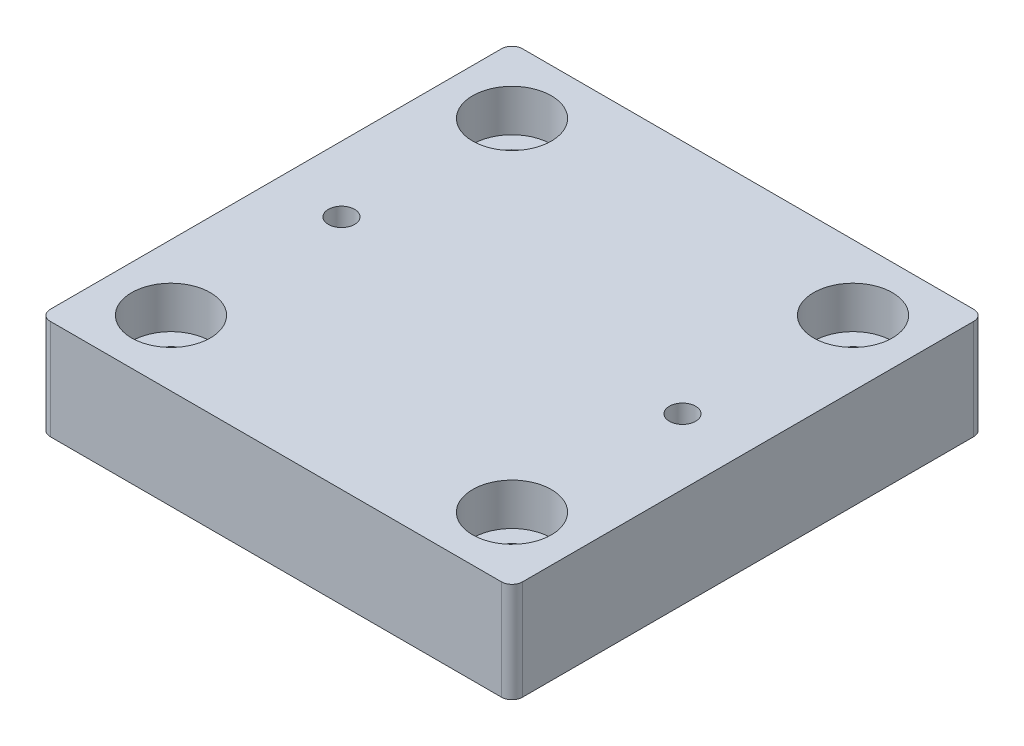
ISO-10303-21;
HEADER;
FILE_DESCRIPTION(('STEP AP214'),'2;1');
FILE_NAME('part.step','',(''),(''),'','','');
FILE_SCHEMA(('AUTOMOTIVE_DESIGN { 1 0 10303 214 1 1 1 1 }'));
ENDSEC;
DATA;
#1=APPLICATION_CONTEXT('core data for automotive mechanical design processes');
#2=APPLICATION_PROTOCOL_DEFINITION('international standard','automotive_design',2000,#1);
#3=PRODUCT_CONTEXT('',#1,'mechanical');
#4=PRODUCT('Part','Part','',(#3));
#5=PRODUCT_RELATED_PRODUCT_CATEGORY('part','',(#4));
#6=PRODUCT_DEFINITION_FORMATION('','',#4);
#7=PRODUCT_DEFINITION_CONTEXT('part definition',#1,'design');
#8=PRODUCT_DEFINITION('design','',#6,#7);
#9=PRODUCT_DEFINITION_SHAPE('','',#8);
#10=(LENGTH_UNIT() NAMED_UNIT(*) SI_UNIT(.MILLI.,.METRE.));
#11=(NAMED_UNIT(*) PLANE_ANGLE_UNIT() SI_UNIT($,.RADIAN.));
#12=(NAMED_UNIT(*) SI_UNIT($,.STERADIAN.) SOLID_ANGLE_UNIT());
#13=UNCERTAINTY_MEASURE_WITH_UNIT(LENGTH_MEASURE(1.E-05),#10,'distance_accuracy_value','');
#14=(GEOMETRIC_REPRESENTATION_CONTEXT(3) GLOBAL_UNCERTAINTY_ASSIGNED_CONTEXT((#13)) GLOBAL_UNIT_ASSIGNED_CONTEXT((#10,
#11,#12)) REPRESENTATION_CONTEXT('',''));
#15=CARTESIAN_POINT('',(0.,0.,0.));
#16=DIRECTION('',(0.,0.,1.));
#17=DIRECTION('',(1.,0.,0.));
#18=AXIS2_PLACEMENT_3D('',#15,#16,#17);
#19=CARTESIAN_POINT('',(-32.5,19.05,-32.5));
#20=DIRECTION('',(0.,-1.,0.));
#21=DIRECTION('',(0.,0.,-1.));
#22=AXIS2_PLACEMENT_3D('',#19,#20,#21);
#23=CYLINDRICAL_SURFACE('',#22,4.);
#24=CARTESIAN_POINT('',(-32.5,0.,-32.5));
#25=DIRECTION('',(0.,1.,0.));
#26=DIRECTION('',(0.,0.,1.));
#27=AXIS2_PLACEMENT_3D('',#24,#25,#26);
#28=CIRCLE('',#27,4.);
#29=CARTESIAN_POINT('',(-32.5,0.,-28.5));
#30=VERTEX_POINT('',#29);
#31=EDGE_CURVE('E162',#30,#30,#28,.T.);
#32=ORIENTED_EDGE('',*,*,#31,.F.);
#33=EDGE_LOOP('',(#32));
#34=FACE_BOUND('',#33,.T.);
#35=CARTESIAN_POINT('',(-32.5,11.05,-32.5));
#36=DIRECTION('',(0.,1.,0.));
#37=DIRECTION('',(0.,0.,1.));
#38=AXIS2_PLACEMENT_3D('',#35,#36,#37);
#39=CIRCLE('',#38,4.);
#40=CARTESIAN_POINT('',(-32.5,11.05,-28.5));
#41=VERTEX_POINT('',#40);
#42=EDGE_CURVE('E57',#41,#41,#39,.T.);
#43=ORIENTED_EDGE('',*,*,#42,.T.);
#44=EDGE_LOOP('',(#43));
#45=FACE_BOUND('',#44,.T.);
#46=ADVANCED_FACE('F53',(#34,#45),#23,.F.);
#47=CARTESIAN_POINT('',(32.5,19.05,-32.5));
#48=DIRECTION('',(0.,-1.,0.));
#49=DIRECTION('',(0.,0.,-1.));
#50=AXIS2_PLACEMENT_3D('',#47,#48,#49);
#51=CYLINDRICAL_SURFACE('',#50,4.00000000000001);
#52=CARTESIAN_POINT('',(32.5,0.,-32.5));
#53=DIRECTION('',(0.,1.,0.));
#54=DIRECTION('',(0.,0.,1.));
#55=AXIS2_PLACEMENT_3D('',#52,#53,#54);
#56=CIRCLE('',#55,4.00000000000001);
#57=CARTESIAN_POINT('',(32.5,0.,-28.5));
#58=VERTEX_POINT('',#57);
#59=EDGE_CURVE('E224',#58,#58,#56,.T.);
#60=ORIENTED_EDGE('',*,*,#59,.F.);
#61=EDGE_LOOP('',(#60));
#62=FACE_BOUND('',#61,.T.);
#63=CARTESIAN_POINT('',(32.5,11.05,-32.5));
#64=DIRECTION('',(0.,1.,0.));
#65=DIRECTION('',(0.,0.,1.));
#66=AXIS2_PLACEMENT_3D('',#63,#64,#65);
#67=CIRCLE('',#66,4.00000000000001);
#68=CARTESIAN_POINT('',(32.5,11.05,-28.5));
#69=VERTEX_POINT('',#68);
#70=EDGE_CURVE('E206',#69,#69,#67,.T.);
#71=ORIENTED_EDGE('',*,*,#70,.T.);
#72=EDGE_LOOP('',(#71));
#73=FACE_BOUND('',#72,.T.);
#74=ADVANCED_FACE('F278',(#62,#73),#51,.F.);
#75=CARTESIAN_POINT('',(32.5,19.05,32.5));
#76=DIRECTION('',(0.,-1.,0.));
#77=DIRECTION('',(0.,0.,-1.));
#78=AXIS2_PLACEMENT_3D('',#75,#76,#77);
#79=CYLINDRICAL_SURFACE('',#78,4.00000000000001);
#80=CARTESIAN_POINT('',(32.5,0.,32.5));
#81=DIRECTION('',(0.,1.,0.));
#82=DIRECTION('',(0.,0.,1.));
#83=AXIS2_PLACEMENT_3D('',#80,#81,#82);
#84=CIRCLE('',#83,4.00000000000001);
#85=CARTESIAN_POINT('',(32.5,0.,36.5));
#86=VERTEX_POINT('',#85);
#87=EDGE_CURVE('E218',#86,#86,#84,.T.);
#88=ORIENTED_EDGE('',*,*,#87,.F.);
#89=EDGE_LOOP('',(#88));
#90=FACE_BOUND('',#89,.T.);
#91=CARTESIAN_POINT('',(32.5,11.05,32.5));
#92=DIRECTION('',(0.,1.,0.));
#93=DIRECTION('',(0.,0.,1.));
#94=AXIS2_PLACEMENT_3D('',#91,#92,#93);
#95=CIRCLE('',#94,4.00000000000001);
#96=CARTESIAN_POINT('',(32.5,11.05,36.5));
#97=VERTEX_POINT('',#96);
#98=EDGE_CURVE('E202',#97,#97,#95,.T.);
#99=ORIENTED_EDGE('',*,*,#98,.T.);
#100=EDGE_LOOP('',(#99));
#101=FACE_BOUND('',#100,.T.);
#102=ADVANCED_FACE('F284',(#90,#101),#79,.F.);
#103=CARTESIAN_POINT('',(-32.5,19.05,32.5));
#104=DIRECTION('',(0.,-1.,0.));
#105=DIRECTION('',(0.,0.,-1.));
#106=AXIS2_PLACEMENT_3D('',#103,#104,#105);
#107=CYLINDRICAL_SURFACE('',#106,4.);
#108=CARTESIAN_POINT('',(-32.5,0.,32.5));
#109=DIRECTION('',(0.,1.,0.));
#110=DIRECTION('',(0.,0.,1.));
#111=AXIS2_PLACEMENT_3D('',#108,#109,#110);
#112=CIRCLE('',#111,4.);
#113=CARTESIAN_POINT('',(-32.5,0.,36.5));
#114=VERTEX_POINT('',#113);
#115=EDGE_CURVE('E213',#114,#114,#112,.T.);
#116=ORIENTED_EDGE('',*,*,#115,.F.);
#117=EDGE_LOOP('',(#116));
#118=FACE_BOUND('',#117,.T.);
#119=CARTESIAN_POINT('',(-32.5,11.05,32.5));
#120=DIRECTION('',(0.,1.,0.));
#121=DIRECTION('',(0.,0.,1.));
#122=AXIS2_PLACEMENT_3D('',#119,#120,#121);
#123=CIRCLE('',#122,4.);
#124=CARTESIAN_POINT('',(-32.5,11.05,36.5));
#125=VERTEX_POINT('',#124);
#126=EDGE_CURVE('E198',#125,#125,#123,.T.);
#127=ORIENTED_EDGE('',*,*,#126,.T.);
#128=EDGE_LOOP('',(#127));
#129=FACE_BOUND('',#128,.T.);
#130=ADVANCED_FACE('F291',(#118,#129),#107,.F.);
#131=CARTESIAN_POINT('',(-43.,19.05,43.));
#132=DIRECTION('',(0.,-1.,0.));
#133=DIRECTION('',(0.,0.,-1.));
#134=AXIS2_PLACEMENT_3D('',#131,#132,#133);
#135=PLANE('',#134);
#136=CARTESIAN_POINT('',(-32.5,19.05,0.));
#137=DIRECTION('',(0.,1.,0.));
#138=DIRECTION('',(0.,0.,1.));
#139=AXIS2_PLACEMENT_3D('',#136,#137,#138);
#140=CIRCLE('',#139,2.5);
#141=CARTESIAN_POINT('',(-32.5,19.05,2.5));
#142=VERTEX_POINT('',#141);
#143=EDGE_CURVE('E561',#142,#142,#140,.T.);
#144=ORIENTED_EDGE('',*,*,#143,.F.);
#145=EDGE_LOOP('',(#144));
#146=FACE_BOUND('',#145,.T.);
#147=CARTESIAN_POINT('',(32.5,19.05,0.));
#148=DIRECTION('',(0.,1.,0.));
#149=DIRECTION('',(0.,0.,1.));
#150=AXIS2_PLACEMENT_3D('',#147,#148,#149);
#151=CIRCLE('',#150,2.5);
#152=CARTESIAN_POINT('',(32.5,19.05,2.5));
#153=VERTEX_POINT('',#152);
#154=EDGE_CURVE('E565',#153,#153,#151,.T.);
#155=ORIENTED_EDGE('',*,*,#154,.F.);
#156=EDGE_LOOP('',(#155));
#157=FACE_BOUND('',#156,.T.);
#158=CARTESIAN_POINT('',(-32.5,19.05,-32.5));
#159=DIRECTION('',(0.,1.,0.));
#160=DIRECTION('',(0.,0.,1.));
#161=AXIS2_PLACEMENT_3D('',#158,#159,#160);
#162=CIRCLE('',#161,7.5);
#163=CARTESIAN_POINT('',(-32.5,19.05,-25.));
#164=VERTEX_POINT('',#163);
#165=EDGE_CURVE('E342',#164,#164,#162,.T.);
#166=ORIENTED_EDGE('',*,*,#165,.F.);
#167=EDGE_LOOP('',(#166));
#168=FACE_BOUND('',#167,.T.);
#169=CARTESIAN_POINT('',(32.5,19.05,-32.5));
#170=DIRECTION('',(0.,1.,0.));
#171=DIRECTION('',(0.,0.,1.));
#172=AXIS2_PLACEMENT_3D('',#169,#170,#171);
#173=CIRCLE('',#172,7.5);
#174=CARTESIAN_POINT('',(32.5,19.05,-25.));
#175=VERTEX_POINT('',#174);
#176=EDGE_CURVE('E328',#175,#175,#173,.T.);
#177=ORIENTED_EDGE('',*,*,#176,.F.);
#178=EDGE_LOOP('',(#177));
#179=FACE_BOUND('',#178,.T.);
#180=CARTESIAN_POINT('',(32.5,19.05,32.5));
#181=DIRECTION('',(0.,1.,0.));
#182=DIRECTION('',(0.,0.,1.));
#183=AXIS2_PLACEMENT_3D('',#180,#181,#182);
#184=CIRCLE('',#183,7.5);
#185=CARTESIAN_POINT('',(32.5,19.05,40.));
#186=VERTEX_POINT('',#185);
#187=EDGE_CURVE('E327',#186,#186,#184,.T.);
#188=ORIENTED_EDGE('',*,*,#187,.F.);
#189=EDGE_LOOP('',(#188));
#190=FACE_BOUND('',#189,.T.);
#191=CARTESIAN_POINT('',(-32.5,19.05,32.5));
#192=DIRECTION('',(0.,1.,0.));
#193=DIRECTION('',(0.,0.,1.));
#194=AXIS2_PLACEMENT_3D('',#191,#192,#193);
#195=CIRCLE('',#194,7.5);
#196=CARTESIAN_POINT('',(-32.5,19.05,40.));
#197=VERTEX_POINT('',#196);
#198=EDGE_CURVE('E227',#197,#197,#195,.T.);
#199=ORIENTED_EDGE('',*,*,#198,.F.);
#200=EDGE_LOOP('',(#199));
#201=FACE_BOUND('',#200,.T.);
#202=CARTESIAN_POINT('',(-43.,19.05,43.));
#203=DIRECTION('',(0.,1.,0.));
#204=DIRECTION('',(0.,0.,-1.));
#205=AXIS2_PLACEMENT_3D('',#202,#203,#204);
#206=CIRCLE('',#205,2.);
#207=CARTESIAN_POINT('',(-45.,19.05,43.));
#208=VERTEX_POINT('',#207);
#209=CARTESIAN_POINT('',(-43.,19.05,45.));
#210=VERTEX_POINT('',#209);
#211=EDGE_CURVE('E180',#208,#210,#206,.T.);
#212=ORIENTED_EDGE('',*,*,#211,.T.);
#213=DIRECTION('',(1.,0.,0.));
#214=VECTOR('',#213,1.);
#215=CARTESIAN_POINT('',(-43.,19.05,45.));
#216=LINE('',#215,#214);
#217=CARTESIAN_POINT('',(43.,19.05,45.));
#218=VERTEX_POINT('',#217);
#219=EDGE_CURVE('E116',#210,#218,#216,.T.);
#220=ORIENTED_EDGE('',*,*,#219,.T.);
#221=CARTESIAN_POINT('',(43.,19.05,43.));
#222=DIRECTION('',(0.,1.,0.));
#223=DIRECTION('',(0.,0.,1.));
#224=AXIS2_PLACEMENT_3D('',#221,#222,#223);
#225=CIRCLE('',#224,2.);
#226=CARTESIAN_POINT('',(45.,19.05,43.));
#227=VERTEX_POINT('',#226);
#228=EDGE_CURVE('E240',#218,#227,#225,.T.);
#229=ORIENTED_EDGE('',*,*,#228,.T.);
#230=DIRECTION('',(0.,0.,-1.));
#231=VECTOR('',#230,1.);
#232=CARTESIAN_POINT('',(45.,19.05,43.));
#233=LINE('',#232,#231);
#234=CARTESIAN_POINT('',(45.,19.05,-43.));
#235=VERTEX_POINT('',#234);
#236=EDGE_CURVE('E243',#227,#235,#233,.T.);
#237=ORIENTED_EDGE('',*,*,#236,.T.);
#238=CARTESIAN_POINT('',(43.,19.05,-43.));
#239=DIRECTION('',(0.,1.,0.));
#240=DIRECTION('',(0.,0.,-1.));
#241=AXIS2_PLACEMENT_3D('',#238,#239,#240);
#242=CIRCLE('',#241,2.);
#243=CARTESIAN_POINT('',(43.,19.05,-45.));
#244=VERTEX_POINT('',#243);
#245=EDGE_CURVE('E135',#235,#244,#242,.T.);
#246=ORIENTED_EDGE('',*,*,#245,.T.);
#247=DIRECTION('',(-1.,0.,0.));
#248=VECTOR('',#247,1.);
#249=CARTESIAN_POINT('',(-43.,19.05,-45.));
#250=LINE('',#249,#248);
#251=CARTESIAN_POINT('',(-43.,19.05,-45.));
#252=VERTEX_POINT('',#251);
#253=EDGE_CURVE('E129',#244,#252,#250,.T.);
#254=ORIENTED_EDGE('',*,*,#253,.T.);
#255=CARTESIAN_POINT('',(-43.,19.05,-43.));
#256=DIRECTION('',(0.,1.,0.));
#257=DIRECTION('',(0.,0.,-1.));
#258=AXIS2_PLACEMENT_3D('',#255,#256,#257);
#259=CIRCLE('',#258,2.);
#260=CARTESIAN_POINT('',(-45.,19.05,-43.));
#261=VERTEX_POINT('',#260);
#262=EDGE_CURVE('E133',#252,#261,#259,.T.);
#263=ORIENTED_EDGE('',*,*,#262,.T.);
#264=DIRECTION('',(0.,0.,1.));
#265=VECTOR('',#264,1.);
#266=CARTESIAN_POINT('',(-45.,19.05,43.));
#267=LINE('',#266,#265);
#268=EDGE_CURVE('E73',#261,#208,#267,.T.);
#269=ORIENTED_EDGE('',*,*,#268,.T.);
#270=EDGE_LOOP('',(#212,#220,#229,#237,#246,#254,#263,#269));
#271=FACE_BOUND('',#270,.T.);
#272=ADVANCED_FACE('F131',(#146,#157,#168,#179,#190,#201,#271),#135,.F.);
#273=CARTESIAN_POINT('',(-43.,0.,43.));
#274=DIRECTION('',(0.,-1.,0.));
#275=DIRECTION('',(0.,0.,-1.));
#276=AXIS2_PLACEMENT_3D('',#273,#274,#275);
#277=PLANE('',#276);
#278=CARTESIAN_POINT('',(-32.5,0.,0.));
#279=DIRECTION('',(0.,1.,0.));
#280=DIRECTION('',(0.,0.,1.));
#281=AXIS2_PLACEMENT_3D('',#278,#279,#280);
#282=CIRCLE('',#281,2.5);
#283=CARTESIAN_POINT('',(-32.5,0.,2.5));
#284=VERTEX_POINT('',#283);
#285=EDGE_CURVE('E304',#284,#284,#282,.T.);
#286=ORIENTED_EDGE('',*,*,#285,.T.);
#287=EDGE_LOOP('',(#286));
#288=FACE_BOUND('',#287,.T.);
#289=CARTESIAN_POINT('',(32.5,0.,0.));
#290=DIRECTION('',(0.,1.,0.));
#291=DIRECTION('',(0.,0.,1.));
#292=AXIS2_PLACEMENT_3D('',#289,#290,#291);
#293=CIRCLE('',#292,2.5);
#294=CARTESIAN_POINT('',(32.5,0.,2.5));
#295=VERTEX_POINT('',#294);
#296=EDGE_CURVE('E308',#295,#295,#293,.T.);
#297=ORIENTED_EDGE('',*,*,#296,.T.);
#298=EDGE_LOOP('',(#297));
#299=FACE_BOUND('',#298,.T.);
#300=ORIENTED_EDGE('',*,*,#87,.T.);
#301=EDGE_LOOP('',(#300));
#302=FACE_BOUND('',#301,.T.);
#303=ORIENTED_EDGE('',*,*,#31,.T.);
#304=EDGE_LOOP('',(#303));
#305=FACE_BOUND('',#304,.T.);
#306=CARTESIAN_POINT('',(-43.,0.,43.));
#307=DIRECTION('',(0.,1.,0.));
#308=DIRECTION('',(0.,0.,-1.));
#309=AXIS2_PLACEMENT_3D('',#306,#307,#308);
#310=CIRCLE('',#309,2.);
#311=CARTESIAN_POINT('',(-45.,0.,43.));
#312=VERTEX_POINT('',#311);
#313=CARTESIAN_POINT('',(-43.,0.,45.));
#314=VERTEX_POINT('',#313);
#315=EDGE_CURVE('E157',#312,#314,#310,.T.);
#316=ORIENTED_EDGE('',*,*,#315,.F.);
#317=DIRECTION('',(0.,0.,1.));
#318=VECTOR('',#317,1.);
#319=CARTESIAN_POINT('',(-45.,0.,43.));
#320=LINE('',#319,#318);
#321=CARTESIAN_POINT('',(-45.,0.,-43.));
#322=VERTEX_POINT('',#321);
#323=EDGE_CURVE('E108',#322,#312,#320,.T.);
#324=ORIENTED_EDGE('',*,*,#323,.F.);
#325=CARTESIAN_POINT('',(-43.,0.,-43.));
#326=DIRECTION('',(0.,1.,0.));
#327=DIRECTION('',(0.,0.,-1.));
#328=AXIS2_PLACEMENT_3D('',#325,#326,#327);
#329=CIRCLE('',#328,2.);
#330=CARTESIAN_POINT('',(-43.,0.,-45.));
#331=VERTEX_POINT('',#330);
#332=EDGE_CURVE('E102',#331,#322,#329,.T.);
#333=ORIENTED_EDGE('',*,*,#332,.F.);
#334=DIRECTION('',(-1.,0.,0.));
#335=VECTOR('',#334,1.);
#336=CARTESIAN_POINT('',(-43.,0.,-45.));
#337=LINE('',#336,#335);
#338=CARTESIAN_POINT('',(43.,0.,-45.));
#339=VERTEX_POINT('',#338);
#340=EDGE_CURVE('E144',#339,#331,#337,.T.);
#341=ORIENTED_EDGE('',*,*,#340,.F.);
#342=CARTESIAN_POINT('',(43.,0.,-43.));
#343=DIRECTION('',(0.,1.,0.));
#344=DIRECTION('',(0.,0.,-1.));
#345=AXIS2_PLACEMENT_3D('',#342,#343,#344);
#346=CIRCLE('',#345,2.);
#347=CARTESIAN_POINT('',(45.,0.,-43.));
#348=VERTEX_POINT('',#347);
#349=EDGE_CURVE('E171',#348,#339,#346,.T.);
#350=ORIENTED_EDGE('',*,*,#349,.F.);
#351=DIRECTION('',(0.,0.,-1.));
#352=VECTOR('',#351,1.);
#353=CARTESIAN_POINT('',(45.,0.,43.));
#354=LINE('',#353,#352);
#355=CARTESIAN_POINT('',(45.,0.,43.));
#356=VERTEX_POINT('',#355);
#357=EDGE_CURVE('E168',#356,#348,#354,.T.);
#358=ORIENTED_EDGE('',*,*,#357,.F.);
#359=CARTESIAN_POINT('',(43.,0.,43.));
#360=DIRECTION('',(0.,1.,0.));
#361=DIRECTION('',(0.,0.,1.));
#362=AXIS2_PLACEMENT_3D('',#359,#360,#361);
#363=CIRCLE('',#362,2.);
#364=CARTESIAN_POINT('',(43.,0.,45.));
#365=VERTEX_POINT('',#364);
#366=EDGE_CURVE('E165',#365,#356,#363,.T.);
#367=ORIENTED_EDGE('',*,*,#366,.F.);
#368=DIRECTION('',(1.,0.,0.));
#369=VECTOR('',#368,1.);
#370=CARTESIAN_POINT('',(-43.,0.,45.));
#371=LINE('',#370,#369);
#372=EDGE_CURVE('E161',#314,#365,#371,.T.);
#373=ORIENTED_EDGE('',*,*,#372,.F.);
#374=EDGE_LOOP('',(#316,#324,#333,#341,#350,#358,#367,#373));
#375=FACE_BOUND('',#374,.T.);
#376=ORIENTED_EDGE('',*,*,#59,.T.);
#377=EDGE_LOOP('',(#376));
#378=FACE_BOUND('',#377,.T.);
#379=ORIENTED_EDGE('',*,*,#115,.T.);
#380=EDGE_LOOP('',(#379));
#381=FACE_BOUND('',#380,.T.);
#382=ADVANCED_FACE('F258',(#288,#299,#302,#305,#375,#378,#381),#277,.T.);
#383=CARTESIAN_POINT('',(-43.,19.05,43.));
#384=DIRECTION('',(0.,-1.,0.));
#385=DIRECTION('',(0.,0.,-1.));
#386=AXIS2_PLACEMENT_3D('',#383,#384,#385);
#387=CYLINDRICAL_SURFACE('',#386,2.);
#388=ORIENTED_EDGE('',*,*,#315,.T.);
#389=DIRECTION('',(0.,-1.,0.));
#390=VECTOR('',#389,1.);
#391=CARTESIAN_POINT('',(-43.,19.05,45.));
#392=LINE('',#391,#390);
#393=EDGE_CURVE('E11',#210,#314,#392,.T.);
#394=ORIENTED_EDGE('',*,*,#393,.F.);
#395=ORIENTED_EDGE('',*,*,#211,.F.);
#396=DIRECTION('',(0.,-1.,0.));
#397=VECTOR('',#396,1.);
#398=CARTESIAN_POINT('',(-45.,19.05,43.));
#399=LINE('',#398,#397);
#400=EDGE_CURVE('E153',#208,#312,#399,.T.);
#401=ORIENTED_EDGE('',*,*,#400,.T.);
#402=EDGE_LOOP('',(#388,#394,#395,#401));
#403=FACE_BOUND('',#402,.T.);
#404=ADVANCED_FACE('F55',(#403),#387,.T.);
#405=CARTESIAN_POINT('',(-43.,19.05,45.));
#406=DIRECTION('',(0.,0.,-1.));
#407=DIRECTION('',(-1.,0.,0.));
#408=AXIS2_PLACEMENT_3D('',#405,#406,#407);
#409=PLANE('',#408);
#410=ORIENTED_EDGE('',*,*,#372,.T.);
#411=DIRECTION('',(0.,-1.,0.));
#412=VECTOR('',#411,1.);
#413=CARTESIAN_POINT('',(43.,19.05,45.));
#414=LINE('',#413,#412);
#415=EDGE_CURVE('E64',#218,#365,#414,.T.);
#416=ORIENTED_EDGE('',*,*,#415,.F.);
#417=ORIENTED_EDGE('',*,*,#219,.F.);
#418=ORIENTED_EDGE('',*,*,#393,.T.);
#419=EDGE_LOOP('',(#410,#416,#417,#418));
#420=FACE_BOUND('',#419,.T.);
#421=ADVANCED_FACE('F300',(#420),#409,.F.);
#422=CARTESIAN_POINT('',(43.,19.05,43.));
#423=DIRECTION('',(0.,-1.,0.));
#424=DIRECTION('',(0.,0.,-1.));
#425=AXIS2_PLACEMENT_3D('',#422,#423,#424);
#426=CYLINDRICAL_SURFACE('',#425,2.);
#427=ORIENTED_EDGE('',*,*,#366,.T.);
#428=DIRECTION('',(0.,-1.,0.));
#429=VECTOR('',#428,1.);
#430=CARTESIAN_POINT('',(45.,19.05,43.));
#431=LINE('',#430,#429);
#432=EDGE_CURVE('E191',#227,#356,#431,.T.);
#433=ORIENTED_EDGE('',*,*,#432,.F.);
#434=ORIENTED_EDGE('',*,*,#228,.F.);
#435=ORIENTED_EDGE('',*,*,#415,.T.);
#436=EDGE_LOOP('',(#427,#433,#434,#435));
#437=FACE_BOUND('',#436,.T.);
#438=ADVANCED_FACE('F499',(#437),#426,.T.);
#439=CARTESIAN_POINT('',(45.,19.05,43.));
#440=DIRECTION('',(-1.,0.,0.));
#441=DIRECTION('',(0.,0.,1.));
#442=AXIS2_PLACEMENT_3D('',#439,#440,#441);
#443=PLANE('',#442);
#444=ORIENTED_EDGE('',*,*,#357,.T.);
#445=DIRECTION('',(0.,-1.,0.));
#446=VECTOR('',#445,1.);
#447=CARTESIAN_POINT('',(45.,19.05,-43.));
#448=LINE('',#447,#446);
#449=EDGE_CURVE('E187',#235,#348,#448,.T.);
#450=ORIENTED_EDGE('',*,*,#449,.F.);
#451=ORIENTED_EDGE('',*,*,#236,.F.);
#452=ORIENTED_EDGE('',*,*,#432,.T.);
#453=EDGE_LOOP('',(#444,#450,#451,#452));
#454=FACE_BOUND('',#453,.T.);
#455=ADVANCED_FACE('F251',(#454),#443,.F.);
#456=CARTESIAN_POINT('',(43.,19.05,-43.));
#457=DIRECTION('',(0.,-1.,0.));
#458=DIRECTION('',(0.,0.,-1.));
#459=AXIS2_PLACEMENT_3D('',#456,#457,#458);
#460=CYLINDRICAL_SURFACE('',#459,2.);
#461=ORIENTED_EDGE('',*,*,#349,.T.);
#462=DIRECTION('',(0.,-1.,0.));
#463=VECTOR('',#462,1.);
#464=CARTESIAN_POINT('',(43.,19.05,-45.));
#465=LINE('',#464,#463);
#466=EDGE_CURVE('E146',#244,#339,#465,.T.);
#467=ORIENTED_EDGE('',*,*,#466,.F.);
#468=ORIENTED_EDGE('',*,*,#245,.F.);
#469=ORIENTED_EDGE('',*,*,#449,.T.);
#470=EDGE_LOOP('',(#461,#467,#468,#469));
#471=FACE_BOUND('',#470,.T.);
#472=ADVANCED_FACE('F255',(#471),#460,.T.);
#473=CARTESIAN_POINT('',(-43.,19.05,-45.));
#474=DIRECTION('',(0.,0.,1.));
#475=DIRECTION('',(1.,0.,0.));
#476=AXIS2_PLACEMENT_3D('',#473,#474,#475);
#477=PLANE('',#476);
#478=ORIENTED_EDGE('',*,*,#340,.T.);
#479=DIRECTION('',(0.,-1.,0.));
#480=VECTOR('',#479,1.);
#481=CARTESIAN_POINT('',(-43.,19.05,-45.));
#482=LINE('',#481,#480);
#483=EDGE_CURVE('E141',#252,#331,#482,.T.);
#484=ORIENTED_EDGE('',*,*,#483,.F.);
#485=ORIENTED_EDGE('',*,*,#253,.F.);
#486=ORIENTED_EDGE('',*,*,#466,.T.);
#487=EDGE_LOOP('',(#478,#484,#485,#486));
#488=FACE_BOUND('',#487,.T.);
#489=ADVANCED_FACE('F142',(#488),#477,.F.);
#490=CARTESIAN_POINT('',(-43.,19.05,-43.));
#491=DIRECTION('',(0.,-1.,0.));
#492=DIRECTION('',(0.,0.,-1.));
#493=AXIS2_PLACEMENT_3D('',#490,#491,#492);
#494=CYLINDRICAL_SURFACE('',#493,2.);
#495=ORIENTED_EDGE('',*,*,#332,.T.);
#496=DIRECTION('',(0.,-1.,0.));
#497=VECTOR('',#496,1.);
#498=CARTESIAN_POINT('',(-45.,19.05,-43.));
#499=LINE('',#498,#497);
#500=EDGE_CURVE('E147',#261,#322,#499,.T.);
#501=ORIENTED_EDGE('',*,*,#500,.F.);
#502=ORIENTED_EDGE('',*,*,#262,.F.);
#503=ORIENTED_EDGE('',*,*,#483,.T.);
#504=EDGE_LOOP('',(#495,#501,#502,#503));
#505=FACE_BOUND('',#504,.T.);
#506=ADVANCED_FACE('F149',(#505),#494,.T.);
#507=CARTESIAN_POINT('',(-45.,19.05,43.));
#508=DIRECTION('',(1.,0.,0.));
#509=DIRECTION('',(0.,0.,-1.));
#510=AXIS2_PLACEMENT_3D('',#507,#508,#509);
#511=PLANE('',#510);
#512=ORIENTED_EDGE('',*,*,#323,.T.);
#513=ORIENTED_EDGE('',*,*,#400,.F.);
#514=ORIENTED_EDGE('',*,*,#268,.F.);
#515=ORIENTED_EDGE('',*,*,#500,.T.);
#516=EDGE_LOOP('',(#512,#513,#514,#515));
#517=FACE_BOUND('',#516,.T.);
#518=ADVANCED_FACE('F264',(#517),#511,.F.);
#519=CARTESIAN_POINT('',(-32.5,11.05,32.5));
#520=DIRECTION('',(0.,1.,0.));
#521=DIRECTION('',(0.,0.,1.));
#522=AXIS2_PLACEMENT_3D('',#519,#520,#521);
#523=CYLINDRICAL_SURFACE('',#522,7.5);
#524=CARTESIAN_POINT('',(-32.5,11.05,32.5));
#525=DIRECTION('',(0.,1.,0.));
#526=DIRECTION('',(0.,0.,1.));
#527=AXIS2_PLACEMENT_3D('',#524,#525,#526);
#528=CIRCLE('',#527,7.5);
#529=CARTESIAN_POINT('',(-32.5,11.05,40.));
#530=VERTEX_POINT('',#529);
#531=EDGE_CURVE('E203',#530,#530,#528,.T.);
#532=ORIENTED_EDGE('',*,*,#531,.F.);
#533=EDGE_LOOP('',(#532));
#534=FACE_BOUND('',#533,.T.);
#535=ORIENTED_EDGE('',*,*,#198,.T.);
#536=EDGE_LOOP('',(#535));
#537=FACE_BOUND('',#536,.T.);
#538=ADVANCED_FACE('F266',(#534,#537),#523,.F.);
#539=CARTESIAN_POINT('',(-32.5,11.05,32.5));
#540=DIRECTION('',(0.,1.,0.));
#541=DIRECTION('',(0.,0.,1.));
#542=AXIS2_PLACEMENT_3D('',#539,#540,#541);
#543=PLANE('',#542);
#544=ORIENTED_EDGE('',*,*,#126,.F.);
#545=EDGE_LOOP('',(#544));
#546=FACE_BOUND('',#545,.T.);
#547=ORIENTED_EDGE('',*,*,#531,.T.);
#548=EDGE_LOOP('',(#547));
#549=FACE_BOUND('',#548,.T.);
#550=ADVANCED_FACE('F273',(#546,#549),#543,.T.);
#551=CARTESIAN_POINT('',(32.5,11.05,32.5));
#552=DIRECTION('',(0.,1.,0.));
#553=DIRECTION('',(0.,0.,1.));
#554=AXIS2_PLACEMENT_3D('',#551,#552,#553);
#555=CYLINDRICAL_SURFACE('',#554,7.5);
#556=CARTESIAN_POINT('',(32.5,11.05,32.5));
#557=DIRECTION('',(0.,1.,0.));
#558=DIRECTION('',(0.,0.,1.));
#559=AXIS2_PLACEMENT_3D('',#556,#557,#558);
#560=CIRCLE('',#559,7.5);
#561=CARTESIAN_POINT('',(32.5,11.05,40.));
#562=VERTEX_POINT('',#561);
#563=EDGE_CURVE('E324',#562,#562,#560,.T.);
#564=ORIENTED_EDGE('',*,*,#563,.F.);
#565=EDGE_LOOP('',(#564));
#566=FACE_BOUND('',#565,.T.);
#567=ORIENTED_EDGE('',*,*,#187,.T.);
#568=EDGE_LOOP('',(#567));
#569=FACE_BOUND('',#568,.T.);
#570=ADVANCED_FACE('F320',(#566,#569),#555,.F.);
#571=CARTESIAN_POINT('',(32.5,11.05,32.5));
#572=DIRECTION('',(0.,1.,0.));
#573=DIRECTION('',(0.,0.,1.));
#574=AXIS2_PLACEMENT_3D('',#571,#572,#573);
#575=PLANE('',#574);
#576=ORIENTED_EDGE('',*,*,#98,.F.);
#577=EDGE_LOOP('',(#576));
#578=FACE_BOUND('',#577,.T.);
#579=ORIENTED_EDGE('',*,*,#563,.T.);
#580=EDGE_LOOP('',(#579));
#581=FACE_BOUND('',#580,.T.);
#582=ADVANCED_FACE('F316',(#578,#581),#575,.T.);
#583=CARTESIAN_POINT('',(32.5,11.05,-32.5));
#584=DIRECTION('',(0.,1.,0.));
#585=DIRECTION('',(0.,0.,1.));
#586=AXIS2_PLACEMENT_3D('',#583,#584,#585);
#587=CYLINDRICAL_SURFACE('',#586,7.5);
#588=CARTESIAN_POINT('',(32.5,11.05,-32.5));
#589=DIRECTION('',(0.,1.,0.));
#590=DIRECTION('',(0.,0.,1.));
#591=AXIS2_PLACEMENT_3D('',#588,#589,#590);
#592=CIRCLE('',#591,7.5);
#593=CARTESIAN_POINT('',(32.5,11.05,-25.));
#594=VERTEX_POINT('',#593);
#595=EDGE_CURVE('E335',#594,#594,#592,.T.);
#596=ORIENTED_EDGE('',*,*,#595,.F.);
#597=EDGE_LOOP('',(#596));
#598=FACE_BOUND('',#597,.T.);
#599=ORIENTED_EDGE('',*,*,#176,.T.);
#600=EDGE_LOOP('',(#599));
#601=FACE_BOUND('',#600,.T.);
#602=ADVANCED_FACE('F319',(#598,#601),#587,.F.);
#603=CARTESIAN_POINT('',(32.5,11.05,-32.5));
#604=DIRECTION('',(0.,1.,0.));
#605=DIRECTION('',(0.,0.,1.));
#606=AXIS2_PLACEMENT_3D('',#603,#604,#605);
#607=PLANE('',#606);
#608=ORIENTED_EDGE('',*,*,#70,.F.);
#609=EDGE_LOOP('',(#608));
#610=FACE_BOUND('',#609,.T.);
#611=ORIENTED_EDGE('',*,*,#595,.T.);
#612=EDGE_LOOP('',(#611));
#613=FACE_BOUND('',#612,.T.);
#614=ADVANCED_FACE('F412',(#610,#613),#607,.T.);
#615=CARTESIAN_POINT('',(-32.5,11.05,-32.5));
#616=DIRECTION('',(0.,1.,0.));
#617=DIRECTION('',(0.,0.,1.));
#618=AXIS2_PLACEMENT_3D('',#615,#616,#617);
#619=CYLINDRICAL_SURFACE('',#618,7.5);
#620=CARTESIAN_POINT('',(-32.5,11.05,-32.5));
#621=DIRECTION('',(0.,1.,0.));
#622=DIRECTION('',(0.,0.,1.));
#623=AXIS2_PLACEMENT_3D('',#620,#621,#622);
#624=CIRCLE('',#623,7.5);
#625=CARTESIAN_POINT('',(-32.5,11.05,-25.));
#626=VERTEX_POINT('',#625);
#627=EDGE_CURVE('E346',#626,#626,#624,.T.);
#628=ORIENTED_EDGE('',*,*,#627,.F.);
#629=EDGE_LOOP('',(#628));
#630=FACE_BOUND('',#629,.T.);
#631=ORIENTED_EDGE('',*,*,#165,.T.);
#632=EDGE_LOOP('',(#631));
#633=FACE_BOUND('',#632,.T.);
#634=ADVANCED_FACE('F422',(#630,#633),#619,.F.);
#635=CARTESIAN_POINT('',(-32.5,11.05,-32.5));
#636=DIRECTION('',(0.,1.,0.));
#637=DIRECTION('',(0.,0.,1.));
#638=AXIS2_PLACEMENT_3D('',#635,#636,#637);
#639=PLANE('',#638);
#640=ORIENTED_EDGE('',*,*,#42,.F.);
#641=EDGE_LOOP('',(#640));
#642=FACE_BOUND('',#641,.T.);
#643=ORIENTED_EDGE('',*,*,#627,.T.);
#644=EDGE_LOOP('',(#643));
#645=FACE_BOUND('',#644,.T.);
#646=ADVANCED_FACE('F367',(#642,#645),#639,.T.);
#647=CARTESIAN_POINT('',(32.5,19.05,0.));
#648=DIRECTION('',(0.,1.,0.));
#649=DIRECTION('',(0.,0.,1.));
#650=AXIS2_PLACEMENT_3D('',#647,#648,#649);
#651=CYLINDRICAL_SURFACE('',#650,2.5);
#652=ORIENTED_EDGE('',*,*,#296,.F.);
#653=EDGE_LOOP('',(#652));
#654=FACE_BOUND('',#653,.T.);
#655=ORIENTED_EDGE('',*,*,#154,.T.);
#656=EDGE_LOOP('',(#655));
#657=FACE_BOUND('',#656,.T.);
#658=ADVANCED_FACE('F440',(#654,#657),#651,.F.);
#659=CARTESIAN_POINT('',(-32.5,19.05,0.));
#660=DIRECTION('',(0.,1.,0.));
#661=DIRECTION('',(0.,0.,1.));
#662=AXIS2_PLACEMENT_3D('',#659,#660,#661);
#663=CYLINDRICAL_SURFACE('',#662,2.5);
#664=ORIENTED_EDGE('',*,*,#285,.F.);
#665=EDGE_LOOP('',(#664));
#666=FACE_BOUND('',#665,.T.);
#667=ORIENTED_EDGE('',*,*,#143,.T.);
#668=EDGE_LOOP('',(#667));
#669=FACE_BOUND('',#668,.T.);
#670=ADVANCED_FACE('F449',(#666,#669),#663,.F.);
#671=CLOSED_SHELL('',(#46,#74,#102,#130,#272,#382,#404,#421,#438,#455,#472,#489,#506,#518,#538,
#550,#570,#582,#602,#614,#634,#646,#658,#670));
#672=MANIFOLD_SOLID_BREP('B2',#671);
#673=ADVANCED_BREP_SHAPE_REPRESENTATION('',(#18,#672),#14);
#674=SHAPE_DEFINITION_REPRESENTATION(#9,#673);
ENDSEC;
END-ISO-10303-21;
